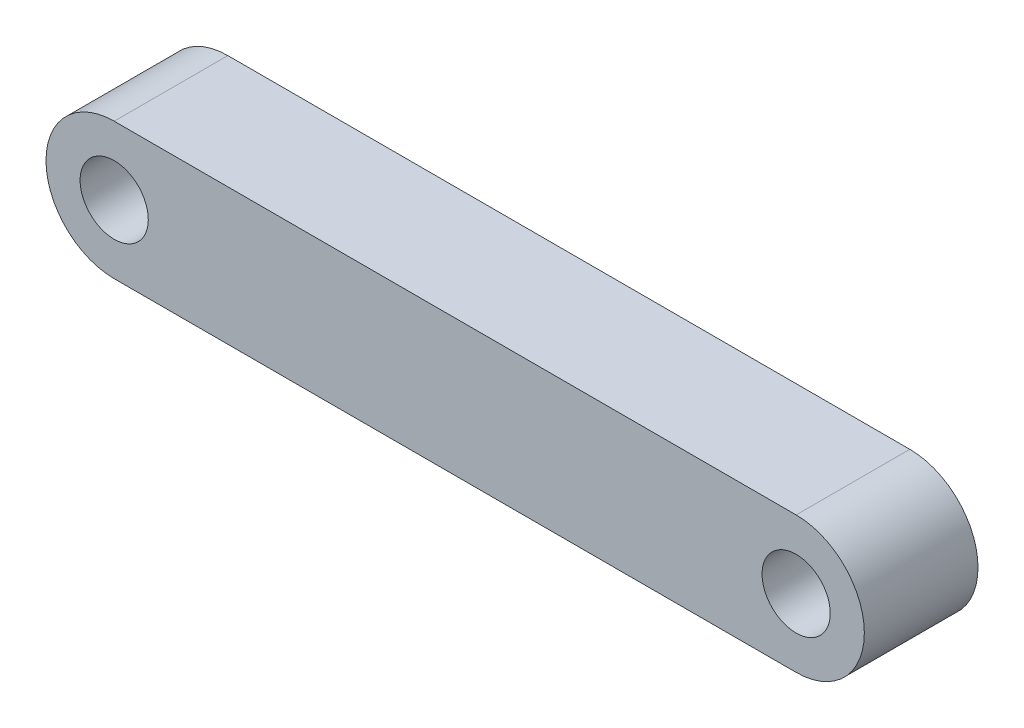
ISO-10303-21;
HEADER;
FILE_DESCRIPTION(('STEP AP214'),'2;1');
FILE_NAME('part.step','',(''),(''),'','','');
FILE_SCHEMA(('AUTOMOTIVE_DESIGN { 1 0 10303 214 1 1 1 1 }'));
ENDSEC;
DATA;
#1=APPLICATION_CONTEXT('core data for automotive mechanical design processes');
#2=APPLICATION_PROTOCOL_DEFINITION('international standard','automotive_design',2000,#1);
#3=PRODUCT_CONTEXT('',#1,'mechanical');
#4=PRODUCT('Part','Part','',(#3));
#5=PRODUCT_RELATED_PRODUCT_CATEGORY('part','',(#4));
#6=PRODUCT_DEFINITION_FORMATION('','',#4);
#7=PRODUCT_DEFINITION_CONTEXT('part definition',#1,'design');
#8=PRODUCT_DEFINITION('design','',#6,#7);
#9=PRODUCT_DEFINITION_SHAPE('','',#8);
#10=(LENGTH_UNIT() NAMED_UNIT(*) SI_UNIT(.MILLI.,.METRE.));
#11=(NAMED_UNIT(*) PLANE_ANGLE_UNIT() SI_UNIT($,.RADIAN.));
#12=(NAMED_UNIT(*) SI_UNIT($,.STERADIAN.) SOLID_ANGLE_UNIT());
#13=UNCERTAINTY_MEASURE_WITH_UNIT(LENGTH_MEASURE(1.E-05),#10,'distance_accuracy_value','');
#14=(GEOMETRIC_REPRESENTATION_CONTEXT(3) GLOBAL_UNCERTAINTY_ASSIGNED_CONTEXT((#13)) GLOBAL_UNIT_ASSIGNED_CONTEXT((#10,
#11,#12)) REPRESENTATION_CONTEXT('',''));
#15=CARTESIAN_POINT('',(0.,0.,0.));
#16=DIRECTION('',(0.,0.,1.));
#17=DIRECTION('',(1.,0.,0.));
#18=AXIS2_PLACEMENT_3D('',#15,#16,#17);
#19=CARTESIAN_POINT('',(0.,0.,5.));
#20=DIRECTION('',(0.,0.,1.));
#21=DIRECTION('',(1.,0.,0.));
#22=AXIS2_PLACEMENT_3D('',#19,#20,#21);
#23=PLANE('',#22);
#24=CARTESIAN_POINT('',(30.,0.,5.));
#25=DIRECTION('',(0.,0.,1.));
#26=DIRECTION('',(1.,0.,0.));
#27=AXIS2_PLACEMENT_3D('',#24,#25,#26);
#28=CIRCLE('',#27,1.5);
#29=CARTESIAN_POINT('',(31.5,0.,5.));
#30=VERTEX_POINT('',#29);
#31=EDGE_CURVE('E110',#30,#30,#28,.T.);
#32=ORIENTED_EDGE('',*,*,#31,.F.);
#33=EDGE_LOOP('',(#32));
#34=FACE_BOUND('',#33,.T.);
#35=CARTESIAN_POINT('',(0.,0.,5.));
#36=DIRECTION('',(0.,0.,1.));
#37=DIRECTION('',(1.,0.,0.));
#38=AXIS2_PLACEMENT_3D('',#35,#36,#37);
#39=CIRCLE('',#38,3.00000000000011);
#40=CARTESIAN_POINT('',(0.,3.00000000000011,5.));
#41=VERTEX_POINT('',#40);
#42=CARTESIAN_POINT('',(0.,-3.00000000000011,5.));
#43=VERTEX_POINT('',#42);
#44=EDGE_CURVE('E95',#41,#43,#39,.T.);
#45=ORIENTED_EDGE('',*,*,#44,.T.);
#46=DIRECTION('',(1.,0.,0.));
#47=VECTOR('',#46,1.);
#48=CARTESIAN_POINT('',(0.,-3.00000000000011,5.));
#49=LINE('',#48,#47);
#50=CARTESIAN_POINT('',(30.,-3.,5.));
#51=VERTEX_POINT('',#50);
#52=EDGE_CURVE('E90',#43,#51,#49,.T.);
#53=ORIENTED_EDGE('',*,*,#52,.T.);
#54=CARTESIAN_POINT('',(30.,0.,5.));
#55=DIRECTION('',(0.,0.,1.));
#56=DIRECTION('',(1.,0.,0.));
#57=AXIS2_PLACEMENT_3D('',#54,#55,#56);
#58=CIRCLE('',#57,3.);
#59=CARTESIAN_POINT('',(30.,3.,5.));
#60=VERTEX_POINT('',#59);
#61=EDGE_CURVE('E93',#51,#60,#58,.T.);
#62=ORIENTED_EDGE('',*,*,#61,.T.);
#63=DIRECTION('',(-1.,0.,0.));
#64=VECTOR('',#63,1.);
#65=CARTESIAN_POINT('',(0.,3.00000000000011,5.));
#66=LINE('',#65,#64);
#67=EDGE_CURVE('E60',#60,#41,#66,.T.);
#68=ORIENTED_EDGE('',*,*,#67,.T.);
#69=EDGE_LOOP('',(#45,#53,#62,#68));
#70=FACE_BOUND('',#69,.T.);
#71=CARTESIAN_POINT('',(0.,0.,5.));
#72=DIRECTION('',(0.,0.,1.));
#73=DIRECTION('',(1.,0.,0.));
#74=AXIS2_PLACEMENT_3D('',#71,#72,#73);
#75=CIRCLE('',#74,1.50000000000006);
#76=CARTESIAN_POINT('',(1.50000000000006,0.,5.));
#77=VERTEX_POINT('',#76);
#78=EDGE_CURVE('E125',#77,#77,#75,.T.);
#79=ORIENTED_EDGE('',*,*,#78,.F.);
#80=EDGE_LOOP('',(#79));
#81=FACE_BOUND('',#80,.T.);
#82=ADVANCED_FACE('F43',(#34,#70,#81),#23,.T.);
#83=CARTESIAN_POINT('',(0.,0.,0.));
#84=DIRECTION('',(0.,0.,1.));
#85=DIRECTION('',(1.,0.,0.));
#86=AXIS2_PLACEMENT_3D('',#83,#84,#85);
#87=PLANE('',#86);
#88=CARTESIAN_POINT('',(0.,0.,0.));
#89=DIRECTION('',(0.,0.,1.));
#90=DIRECTION('',(1.,0.,0.));
#91=AXIS2_PLACEMENT_3D('',#88,#89,#90);
#92=CIRCLE('',#91,3.00000000000011);
#93=CARTESIAN_POINT('',(0.,3.00000000000011,0.));
#94=VERTEX_POINT('',#93);
#95=CARTESIAN_POINT('',(0.,-3.00000000000011,0.));
#96=VERTEX_POINT('',#95);
#97=EDGE_CURVE('E107',#94,#96,#92,.T.);
#98=ORIENTED_EDGE('',*,*,#97,.F.);
#99=DIRECTION('',(-1.,0.,0.));
#100=VECTOR('',#99,1.);
#101=CARTESIAN_POINT('',(0.,3.00000000000011,0.));
#102=LINE('',#101,#100);
#103=CARTESIAN_POINT('',(30.,3.,0.));
#104=VERTEX_POINT('',#103);
#105=EDGE_CURVE('E83',#104,#94,#102,.T.);
#106=ORIENTED_EDGE('',*,*,#105,.F.);
#107=CARTESIAN_POINT('',(30.,0.,0.));
#108=DIRECTION('',(0.,0.,1.));
#109=DIRECTION('',(1.,0.,0.));
#110=AXIS2_PLACEMENT_3D('',#107,#108,#109);
#111=CIRCLE('',#110,3.);
#112=CARTESIAN_POINT('',(30.,-3.,0.));
#113=VERTEX_POINT('',#112);
#114=EDGE_CURVE('E77',#113,#104,#111,.T.);
#115=ORIENTED_EDGE('',*,*,#114,.F.);
#116=DIRECTION('',(1.,0.,0.));
#117=VECTOR('',#116,1.);
#118=CARTESIAN_POINT('',(0.,-3.00000000000011,0.));
#119=LINE('',#118,#117);
#120=EDGE_CURVE('E99',#96,#113,#119,.T.);
#121=ORIENTED_EDGE('',*,*,#120,.F.);
#122=EDGE_LOOP('',(#98,#106,#115,#121));
#123=FACE_BOUND('',#122,.T.);
#124=CARTESIAN_POINT('',(30.,0.,0.));
#125=DIRECTION('',(0.,0.,1.));
#126=DIRECTION('',(1.,0.,0.));
#127=AXIS2_PLACEMENT_3D('',#124,#125,#126);
#128=CIRCLE('',#127,1.5);
#129=CARTESIAN_POINT('',(31.5,0.,0.));
#130=VERTEX_POINT('',#129);
#131=EDGE_CURVE('E122',#130,#130,#128,.T.);
#132=ORIENTED_EDGE('',*,*,#131,.T.);
#133=EDGE_LOOP('',(#132));
#134=FACE_BOUND('',#133,.T.);
#135=CARTESIAN_POINT('',(0.,0.,0.));
#136=DIRECTION('',(0.,0.,1.));
#137=DIRECTION('',(1.,0.,0.));
#138=AXIS2_PLACEMENT_3D('',#135,#136,#137);
#139=CIRCLE('',#138,1.50000000000006);
#140=CARTESIAN_POINT('',(1.50000000000006,0.,0.));
#141=VERTEX_POINT('',#140);
#142=EDGE_CURVE('E128',#141,#141,#139,.T.);
#143=ORIENTED_EDGE('',*,*,#142,.T.);
#144=EDGE_LOOP('',(#143));
#145=FACE_BOUND('',#144,.T.);
#146=ADVANCED_FACE('F118',(#123,#134,#145),#87,.F.);
#147=CARTESIAN_POINT('',(0.,0.,5.));
#148=DIRECTION('',(0.,0.,-1.));
#149=DIRECTION('',(-1.,0.,0.));
#150=AXIS2_PLACEMENT_3D('',#147,#148,#149);
#151=CYLINDRICAL_SURFACE('',#150,3.00000000000011);
#152=ORIENTED_EDGE('',*,*,#97,.T.);
#153=DIRECTION('',(0.,0.,-1.));
#154=VECTOR('',#153,1.);
#155=CARTESIAN_POINT('',(0.,-3.00000000000011,5.));
#156=LINE('',#155,#154);
#157=EDGE_CURVE('E11',#43,#96,#156,.T.);
#158=ORIENTED_EDGE('',*,*,#157,.F.);
#159=ORIENTED_EDGE('',*,*,#44,.F.);
#160=DIRECTION('',(0.,0.,-1.));
#161=VECTOR('',#160,1.);
#162=CARTESIAN_POINT('',(0.,3.00000000000011,5.));
#163=LINE('',#162,#161);
#164=EDGE_CURVE('E103',#41,#94,#163,.T.);
#165=ORIENTED_EDGE('',*,*,#164,.T.);
#166=EDGE_LOOP('',(#152,#158,#159,#165));
#167=FACE_BOUND('',#166,.T.);
#168=ADVANCED_FACE('F45',(#167),#151,.T.);
#169=CARTESIAN_POINT('',(0.,-3.00000000000011,5.));
#170=DIRECTION('',(0.,1.,0.));
#171=DIRECTION('',(-1.,0.,0.));
#172=AXIS2_PLACEMENT_3D('',#169,#170,#171);
#173=PLANE('',#172);
#174=ORIENTED_EDGE('',*,*,#120,.T.);
#175=DIRECTION('',(0.,0.,-1.));
#176=VECTOR('',#175,1.);
#177=CARTESIAN_POINT('',(30.,-3.,5.));
#178=LINE('',#177,#176);
#179=EDGE_CURVE('E52',#51,#113,#178,.T.);
#180=ORIENTED_EDGE('',*,*,#179,.F.);
#181=ORIENTED_EDGE('',*,*,#52,.F.);
#182=ORIENTED_EDGE('',*,*,#157,.T.);
#183=EDGE_LOOP('',(#174,#180,#181,#182));
#184=FACE_BOUND('',#183,.T.);
#185=ADVANCED_FACE('F98',(#184),#173,.F.);
#186=CARTESIAN_POINT('',(30.,0.,5.));
#187=DIRECTION('',(0.,0.,-1.));
#188=DIRECTION('',(-1.,0.,0.));
#189=AXIS2_PLACEMENT_3D('',#186,#187,#188);
#190=CYLINDRICAL_SURFACE('',#189,3.);
#191=ORIENTED_EDGE('',*,*,#114,.T.);
#192=DIRECTION('',(0.,0.,-1.));
#193=VECTOR('',#192,1.);
#194=CARTESIAN_POINT('',(30.,3.,5.));
#195=LINE('',#194,#193);
#196=EDGE_CURVE('E100',#60,#104,#195,.T.);
#197=ORIENTED_EDGE('',*,*,#196,.F.);
#198=ORIENTED_EDGE('',*,*,#61,.F.);
#199=ORIENTED_EDGE('',*,*,#179,.T.);
#200=EDGE_LOOP('',(#191,#197,#198,#199));
#201=FACE_BOUND('',#200,.T.);
#202=ADVANCED_FACE('F101',(#201),#190,.T.);
#203=CARTESIAN_POINT('',(0.,3.00000000000011,5.));
#204=DIRECTION('',(0.,-1.,0.));
#205=DIRECTION('',(1.,0.,0.));
#206=AXIS2_PLACEMENT_3D('',#203,#204,#205);
#207=PLANE('',#206);
#208=ORIENTED_EDGE('',*,*,#105,.T.);
#209=ORIENTED_EDGE('',*,*,#164,.F.);
#210=ORIENTED_EDGE('',*,*,#67,.F.);
#211=ORIENTED_EDGE('',*,*,#196,.T.);
#212=EDGE_LOOP('',(#208,#209,#210,#211));
#213=FACE_BOUND('',#212,.T.);
#214=ADVANCED_FACE('F115',(#213),#207,.F.);
#215=CARTESIAN_POINT('',(30.,0.,5.));
#216=DIRECTION('',(0.,0.,-1.));
#217=DIRECTION('',(-1.,0.,0.));
#218=AXIS2_PLACEMENT_3D('',#215,#216,#217);
#219=CYLINDRICAL_SURFACE('',#218,1.5);
#220=ORIENTED_EDGE('',*,*,#31,.T.);
#221=EDGE_LOOP('',(#220));
#222=FACE_BOUND('',#221,.T.);
#223=ORIENTED_EDGE('',*,*,#131,.F.);
#224=EDGE_LOOP('',(#223));
#225=FACE_BOUND('',#224,.T.);
#226=ADVANCED_FACE('F144',(#222,#225),#219,.F.);
#227=CARTESIAN_POINT('',(0.,0.,5.));
#228=DIRECTION('',(0.,0.,-1.));
#229=DIRECTION('',(-1.,0.,0.));
#230=AXIS2_PLACEMENT_3D('',#227,#228,#229);
#231=CYLINDRICAL_SURFACE('',#230,1.50000000000006);
#232=ORIENTED_EDGE('',*,*,#78,.T.);
#233=EDGE_LOOP('',(#232));
#234=FACE_BOUND('',#233,.T.);
#235=ORIENTED_EDGE('',*,*,#142,.F.);
#236=EDGE_LOOP('',(#235));
#237=FACE_BOUND('',#236,.T.);
#238=ADVANCED_FACE('F134',(#234,#237),#231,.F.);
#239=CLOSED_SHELL('',(#82,#146,#168,#185,#202,#214,#226,#238));
#240=MANIFOLD_SOLID_BREP('B2',#239);
#241=ADVANCED_BREP_SHAPE_REPRESENTATION('',(#18,#240),#14);
#242=SHAPE_DEFINITION_REPRESENTATION(#9,#241);
ENDSEC;
END-ISO-10303-21;
